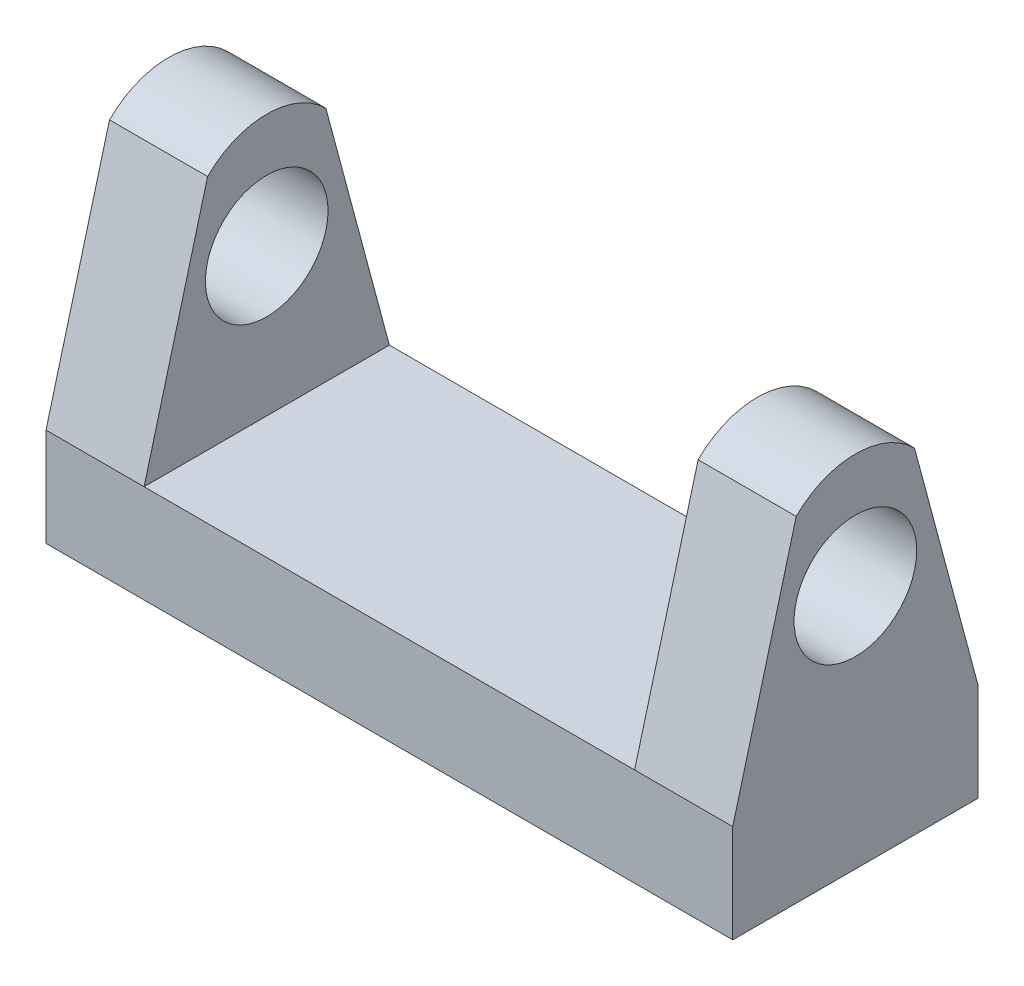
ISO-10303-21;
HEADER;
FILE_DESCRIPTION(('STEP AP214'),'2;1');
FILE_NAME('part.step','',(''),(''),'','','');
FILE_SCHEMA(('AUTOMOTIVE_DESIGN { 1 0 10303 214 1 1 1 1 }'));
ENDSEC;
DATA;
#1=APPLICATION_CONTEXT('core data for automotive mechanical design processes');
#2=APPLICATION_PROTOCOL_DEFINITION('international standard','automotive_design',2000,#1);
#3=PRODUCT_CONTEXT('',#1,'mechanical');
#4=PRODUCT('Part','Part','',(#3));
#5=PRODUCT_RELATED_PRODUCT_CATEGORY('part','',(#4));
#6=PRODUCT_DEFINITION_FORMATION('','',#4);
#7=PRODUCT_DEFINITION_CONTEXT('part definition',#1,'design');
#8=PRODUCT_DEFINITION('design','',#6,#7);
#9=PRODUCT_DEFINITION_SHAPE('','',#8);
#10=(LENGTH_UNIT() NAMED_UNIT(*) SI_UNIT(.MILLI.,.METRE.));
#11=(NAMED_UNIT(*) PLANE_ANGLE_UNIT() SI_UNIT($,.RADIAN.));
#12=(NAMED_UNIT(*) SI_UNIT($,.STERADIAN.) SOLID_ANGLE_UNIT());
#13=UNCERTAINTY_MEASURE_WITH_UNIT(LENGTH_MEASURE(1.E-05),#10,'distance_accuracy_value','');
#14=(GEOMETRIC_REPRESENTATION_CONTEXT(3) GLOBAL_UNCERTAINTY_ASSIGNED_CONTEXT((#13)) GLOBAL_UNIT_ASSIGNED_CONTEXT((#10,
#11,#12)) REPRESENTATION_CONTEXT('',''));
#15=CARTESIAN_POINT('',(0.,0.,0.));
#16=DIRECTION('',(0.,0.,1.));
#17=DIRECTION('',(1.,0.,0.));
#18=AXIS2_PLACEMENT_3D('',#15,#16,#17);
#19=CARTESIAN_POINT('',(-17.78,5.08,6.34999999999999));
#20=DIRECTION('',(-1.,0.,0.));
#21=DIRECTION('',(0.,0.,1.));
#22=AXIS2_PLACEMENT_3D('',#19,#20,#21);
#23=PLANE('',#22);
#24=CARTESIAN_POINT('',(-17.78,12.7,0.));
#25=DIRECTION('',(1.,0.,0.));
#26=DIRECTION('',(0.,0.,-1.));
#27=AXIS2_PLACEMENT_3D('',#24,#25,#26);
#28=CIRCLE('',#27,3.175);
#29=CARTESIAN_POINT('',(-17.78,12.7,-3.175));
#30=VERTEX_POINT('',#29);
#31=EDGE_CURVE('E194',#30,#30,#28,.T.);
#32=ORIENTED_EDGE('',*,*,#31,.T.);
#33=EDGE_LOOP('',(#32));
#34=FACE_BOUND('',#33,.T.);
#35=DIRECTION('',(0.,0.,-1.));
#36=VECTOR('',#35,1.);
#37=CARTESIAN_POINT('',(-17.78,0.,6.34999999999999));
#38=LINE('',#37,#36);
#39=CARTESIAN_POINT('',(-17.78,0.,6.34999999999999));
#40=VERTEX_POINT('',#39);
#41=CARTESIAN_POINT('',(-17.78,0.,-6.34999999999999));
#42=VERTEX_POINT('',#41);
#43=EDGE_CURVE('E106',#40,#42,#38,.T.);
#44=ORIENTED_EDGE('',*,*,#43,.F.);
#45=DIRECTION('',(0.,-1.,0.));
#46=VECTOR('',#45,1.);
#47=CARTESIAN_POINT('',(-17.78,5.08,6.34999999999999));
#48=LINE('',#47,#46);
#49=CARTESIAN_POINT('',(-17.78,5.08,6.34999999999999));
#50=VERTEX_POINT('',#49);
#51=EDGE_CURVE('E11',#50,#40,#48,.T.);
#52=ORIENTED_EDGE('',*,*,#51,.F.);
#53=DIRECTION('',(0.,-0.965925826289069,0.258819045102518));
#54=VECTOR('',#53,1.);
#55=CARTESIAN_POINT('',(-17.78,5.08,6.34999999999999));
#56=LINE('',#55,#54);
#57=CARTESIAN_POINT('',(-17.78,17.3472579938712,3.06299812719801));
#58=VERTEX_POINT('',#57);
#59=EDGE_CURVE('E176',#58,#50,#56,.T.);
#60=ORIENTED_EDGE('',*,*,#59,.F.);
#61=CARTESIAN_POINT('',(-17.78,14.2842598666732,0.));
#62=DIRECTION('',(1.,0.,0.));
#63=DIRECTION('',(0.,0.,1.));
#64=AXIS2_PLACEMENT_3D('',#61,#62,#63);
#65=CIRCLE('',#64,4.33173349300677);
#66=CARTESIAN_POINT('',(-17.78,17.3472579938712,-3.06299812719793));
#67=VERTEX_POINT('',#66);
#68=EDGE_CURVE('E173',#67,#58,#65,.T.);
#69=ORIENTED_EDGE('',*,*,#68,.F.);
#70=DIRECTION('',(0.,0.965925826289067,0.258819045102525));
#71=VECTOR('',#70,1.);
#72=CARTESIAN_POINT('',(-17.78,5.08,-6.34999999999999));
#73=LINE('',#72,#71);
#74=CARTESIAN_POINT('',(-17.78,5.08,-6.34999999999999));
#75=VERTEX_POINT('',#74);
#76=EDGE_CURVE('E170',#75,#67,#73,.T.);
#77=ORIENTED_EDGE('',*,*,#76,.F.);
#78=DIRECTION('',(0.,-1.,0.));
#79=VECTOR('',#78,1.);
#80=CARTESIAN_POINT('',(-17.78,5.08,-6.34999999999999));
#81=LINE('',#80,#79);
#82=EDGE_CURVE('E110',#75,#42,#81,.T.);
#83=ORIENTED_EDGE('',*,*,#82,.T.);
#84=EDGE_LOOP('',(#44,#52,#60,#69,#77,#83));
#85=FACE_BOUND('',#84,.T.);
#86=ADVANCED_FACE('F37',(#34,#85),#23,.T.);
#87=CARTESIAN_POINT('',(-17.78,5.08,6.34999999999999));
#88=DIRECTION('',(0.,0.,-1.));
#89=DIRECTION('',(-1.,0.,0.));
#90=AXIS2_PLACEMENT_3D('',#87,#88,#89);
#91=PLANE('',#90);
#92=DIRECTION('',(1.,0.,0.));
#93=VECTOR('',#92,1.);
#94=CARTESIAN_POINT('',(-17.78,0.,6.34999999999999));
#95=LINE('',#94,#93);
#96=CARTESIAN_POINT('',(17.78,0.,6.34999999999999));
#97=VERTEX_POINT('',#96);
#98=EDGE_CURVE('E79',#40,#97,#95,.T.);
#99=ORIENTED_EDGE('',*,*,#98,.T.);
#100=DIRECTION('',(0.,-1.,0.));
#101=VECTOR('',#100,1.);
#102=CARTESIAN_POINT('',(17.78,5.08,6.34999999999999));
#103=LINE('',#102,#101);
#104=CARTESIAN_POINT('',(17.78,5.08,6.34999999999999));
#105=VERTEX_POINT('',#104);
#106=EDGE_CURVE('E45',#105,#97,#103,.T.);
#107=ORIENTED_EDGE('',*,*,#106,.F.);
#108=DIRECTION('',(1.,0.,0.));
#109=VECTOR('',#108,1.);
#110=CARTESIAN_POINT('',(12.7,5.08,6.34999999999999));
#111=LINE('',#110,#109);
#112=CARTESIAN_POINT('',(12.7,5.08,6.34999999999999));
#113=VERTEX_POINT('',#112);
#114=EDGE_CURVE('E125',#113,#105,#111,.T.);
#115=ORIENTED_EDGE('',*,*,#114,.F.);
#116=DIRECTION('',(1.,0.,0.));
#117=VECTOR('',#116,1.);
#118=CARTESIAN_POINT('',(-17.78,5.08,6.34999999999999));
#119=LINE('',#118,#117);
#120=CARTESIAN_POINT('',(-12.7,5.08,6.34999999999999));
#121=VERTEX_POINT('',#120);
#122=EDGE_CURVE('E115',#121,#113,#119,.T.);
#123=ORIENTED_EDGE('',*,*,#122,.F.);
#124=EDGE_CURVE('E111',#50,#121,#119,.T.);
#125=ORIENTED_EDGE('',*,*,#124,.F.);
#126=ORIENTED_EDGE('',*,*,#51,.T.);
#127=EDGE_LOOP('',(#99,#107,#115,#123,#125,#126));
#128=FACE_BOUND('',#127,.T.);
#129=ADVANCED_FACE('F81',(#128),#91,.F.);
#130=CARTESIAN_POINT('',(17.78,5.08,6.34999999999999));
#131=DIRECTION('',(-1.,0.,0.));
#132=DIRECTION('',(0.,0.,1.));
#133=AXIS2_PLACEMENT_3D('',#130,#131,#132);
#134=PLANE('',#133);
#135=CARTESIAN_POINT('',(17.78,12.7,0.));
#136=DIRECTION('',(1.,0.,0.));
#137=DIRECTION('',(0.,0.,-1.));
#138=AXIS2_PLACEMENT_3D('',#135,#136,#137);
#139=CIRCLE('',#138,3.175);
#140=CARTESIAN_POINT('',(17.78,12.7,-3.175));
#141=VERTEX_POINT('',#140);
#142=EDGE_CURVE('E191',#141,#141,#139,.T.);
#143=ORIENTED_EDGE('',*,*,#142,.F.);
#144=EDGE_LOOP('',(#143));
#145=FACE_BOUND('',#144,.T.);
#146=DIRECTION('',(0.,0.,-1.));
#147=VECTOR('',#146,1.);
#148=CARTESIAN_POINT('',(17.78,0.,6.34999999999999));
#149=LINE('',#148,#147);
#150=CARTESIAN_POINT('',(17.78,0.,-6.34999999999999));
#151=VERTEX_POINT('',#150);
#152=EDGE_CURVE('E89',#97,#151,#149,.T.);
#153=ORIENTED_EDGE('',*,*,#152,.T.);
#154=DIRECTION('',(0.,-1.,0.));
#155=VECTOR('',#154,1.);
#156=CARTESIAN_POINT('',(17.78,5.08,-6.34999999999999));
#157=LINE('',#156,#155);
#158=CARTESIAN_POINT('',(17.78,5.08,-6.34999999999999));
#159=VERTEX_POINT('',#158);
#160=EDGE_CURVE('E100',#159,#151,#157,.T.);
#161=ORIENTED_EDGE('',*,*,#160,.F.);
#162=DIRECTION('',(0.,0.965925826289067,0.258819045102525));
#163=VECTOR('',#162,1.);
#164=CARTESIAN_POINT('',(17.78,5.08,-6.34999999999999));
#165=LINE('',#164,#163);
#166=CARTESIAN_POINT('',(17.78,17.3472579938712,-3.06299812719793));
#167=VERTEX_POINT('',#166);
#168=EDGE_CURVE('E151',#159,#167,#165,.T.);
#169=ORIENTED_EDGE('',*,*,#168,.T.);
#170=CARTESIAN_POINT('',(17.78,14.2842598666732,0.));
#171=DIRECTION('',(1.,0.,0.));
#172=DIRECTION('',(0.,0.,1.));
#173=AXIS2_PLACEMENT_3D('',#170,#171,#172);
#174=CIRCLE('',#173,4.33173349300677);
#175=CARTESIAN_POINT('',(17.78,17.3472579938712,3.06299812719801));
#176=VERTEX_POINT('',#175);
#177=EDGE_CURVE('E153',#167,#176,#174,.T.);
#178=ORIENTED_EDGE('',*,*,#177,.T.);
#179=DIRECTION('',(0.,-0.965925826289069,0.258819045102518));
#180=VECTOR('',#179,1.);
#181=CARTESIAN_POINT('',(17.78,5.08,6.34999999999999));
#182=LINE('',#181,#180);
#183=EDGE_CURVE('E99',#176,#105,#182,.T.);
#184=ORIENTED_EDGE('',*,*,#183,.T.);
#185=ORIENTED_EDGE('',*,*,#106,.T.);
#186=EDGE_LOOP('',(#153,#161,#169,#178,#184,#185));
#187=FACE_BOUND('',#186,.T.);
#188=ADVANCED_FACE('F94',(#145,#187),#134,.F.);
#189=CARTESIAN_POINT('',(-17.78,5.08,-6.34999999999999));
#190=DIRECTION('',(0.,0.,-1.));
#191=DIRECTION('',(-1.,0.,0.));
#192=AXIS2_PLACEMENT_3D('',#189,#190,#191);
#193=PLANE('',#192);
#194=DIRECTION('',(1.,0.,0.));
#195=VECTOR('',#194,1.);
#196=CARTESIAN_POINT('',(-17.78,0.,-6.34999999999999));
#197=LINE('',#196,#195);
#198=EDGE_CURVE('E104',#42,#151,#197,.T.);
#199=ORIENTED_EDGE('',*,*,#198,.F.);
#200=ORIENTED_EDGE('',*,*,#82,.F.);
#201=DIRECTION('',(1.,0.,0.));
#202=VECTOR('',#201,1.);
#203=CARTESIAN_POINT('',(-17.78,5.08,-6.34999999999999));
#204=LINE('',#203,#202);
#205=CARTESIAN_POINT('',(-12.7,5.08,-6.34999999999999));
#206=VERTEX_POINT('',#205);
#207=EDGE_CURVE('E61',#75,#206,#204,.T.);
#208=ORIENTED_EDGE('',*,*,#207,.T.);
#209=CARTESIAN_POINT('',(12.7,5.08,-6.34999999999999));
#210=VERTEX_POINT('',#209);
#211=EDGE_CURVE('E53',#206,#210,#204,.T.);
#212=ORIENTED_EDGE('',*,*,#211,.T.);
#213=DIRECTION('',(1.,0.,0.));
#214=VECTOR('',#213,1.);
#215=CARTESIAN_POINT('',(12.7,5.08,-6.34999999999999));
#216=LINE('',#215,#214);
#217=EDGE_CURVE('E138',#210,#159,#216,.T.);
#218=ORIENTED_EDGE('',*,*,#217,.T.);
#219=ORIENTED_EDGE('',*,*,#160,.T.);
#220=EDGE_LOOP('',(#199,#200,#208,#212,#218,#219));
#221=FACE_BOUND('',#220,.T.);
#222=ADVANCED_FACE('F215',(#221),#193,.T.);
#223=CARTESIAN_POINT('',(0.,5.08,0.));
#224=DIRECTION('',(0.,-1.,0.));
#225=DIRECTION('',(0.,0.,-1.));
#226=AXIS2_PLACEMENT_3D('',#223,#224,#225);
#227=PLANE('',#226);
#228=ORIENTED_EDGE('',*,*,#211,.F.);
#229=DIRECTION('',(0.,0.,-1.));
#230=VECTOR('',#229,1.);
#231=CARTESIAN_POINT('',(-12.7,5.08,6.34999999999999));
#232=LINE('',#231,#230);
#233=EDGE_CURVE('E172',#121,#206,#232,.T.);
#234=ORIENTED_EDGE('',*,*,#233,.F.);
#235=ORIENTED_EDGE('',*,*,#122,.T.);
#236=DIRECTION('',(0.,0.,-1.));
#237=VECTOR('',#236,1.);
#238=CARTESIAN_POINT('',(12.7,5.08,6.34999999999999));
#239=LINE('',#238,#237);
#240=EDGE_CURVE('E157',#113,#210,#239,.T.);
#241=ORIENTED_EDGE('',*,*,#240,.T.);
#242=EDGE_LOOP('',(#228,#234,#235,#241));
#243=FACE_BOUND('',#242,.T.);
#244=ADVANCED_FACE('F214',(#243),#227,.F.);
#245=CARTESIAN_POINT('',(0.,0.,0.));
#246=DIRECTION('',(0.,-1.,0.));
#247=DIRECTION('',(0.,0.,-1.));
#248=AXIS2_PLACEMENT_3D('',#245,#246,#247);
#249=PLANE('',#248);
#250=ORIENTED_EDGE('',*,*,#43,.T.);
#251=ORIENTED_EDGE('',*,*,#198,.T.);
#252=ORIENTED_EDGE('',*,*,#152,.F.);
#253=ORIENTED_EDGE('',*,*,#98,.F.);
#254=EDGE_LOOP('',(#250,#251,#252,#253));
#255=FACE_BOUND('',#254,.T.);
#256=ADVANCED_FACE('F102',(#255),#249,.T.);
#257=CARTESIAN_POINT('',(12.7,5.08,6.34999999999999));
#258=DIRECTION('',(0.,0.258819045102518,0.965925826289069));
#259=DIRECTION('',(0.,-0.965925826289069,0.258819045102518));
#260=AXIS2_PLACEMENT_3D('',#257,#258,#259);
#261=PLANE('',#260);
#262=ORIENTED_EDGE('',*,*,#183,.F.);
#263=DIRECTION('',(1.,0.,0.));
#264=VECTOR('',#263,1.);
#265=CARTESIAN_POINT('',(12.7,17.3472579938712,3.06299812719801));
#266=LINE('',#265,#264);
#267=CARTESIAN_POINT('',(12.7,17.3472579938712,3.06299812719801));
#268=VERTEX_POINT('',#267);
#269=EDGE_CURVE('E127',#268,#176,#266,.T.);
#270=ORIENTED_EDGE('',*,*,#269,.F.);
#271=DIRECTION('',(0.,-0.965925826289069,0.258819045102518));
#272=VECTOR('',#271,1.);
#273=CARTESIAN_POINT('',(12.7,5.08,6.34999999999999));
#274=LINE('',#273,#272);
#275=EDGE_CURVE('E139',#268,#113,#274,.T.);
#276=ORIENTED_EDGE('',*,*,#275,.T.);
#277=ORIENTED_EDGE('',*,*,#114,.T.);
#278=EDGE_LOOP('',(#262,#270,#276,#277));
#279=FACE_BOUND('',#278,.T.);
#280=ADVANCED_FACE('F269',(#279),#261,.T.);
#281=CARTESIAN_POINT('',(12.7,14.2842598666732,0.));
#282=DIRECTION('',(1.,0.,0.));
#283=DIRECTION('',(0.,0.,-1.));
#284=AXIS2_PLACEMENT_3D('',#281,#282,#283);
#285=CYLINDRICAL_SURFACE('',#284,4.33173349300677);
#286=ORIENTED_EDGE('',*,*,#177,.F.);
#287=DIRECTION('',(1.,0.,0.));
#288=VECTOR('',#287,1.);
#289=CARTESIAN_POINT('',(12.7,17.3472579938712,-3.06299812719793));
#290=LINE('',#289,#288);
#291=CARTESIAN_POINT('',(12.7,17.3472579938712,-3.06299812719793));
#292=VERTEX_POINT('',#291);
#293=EDGE_CURVE('E132',#292,#167,#290,.T.);
#294=ORIENTED_EDGE('',*,*,#293,.F.);
#295=CARTESIAN_POINT('',(12.7,14.2842598666732,0.));
#296=DIRECTION('',(1.,0.,0.));
#297=DIRECTION('',(0.,0.,1.));
#298=AXIS2_PLACEMENT_3D('',#295,#296,#297);
#299=CIRCLE('',#298,4.33173349300677);
#300=EDGE_CURVE('E142',#292,#268,#299,.T.);
#301=ORIENTED_EDGE('',*,*,#300,.T.);
#302=ORIENTED_EDGE('',*,*,#269,.T.);
#303=EDGE_LOOP('',(#286,#294,#301,#302));
#304=FACE_BOUND('',#303,.T.);
#305=ADVANCED_FACE('F262',(#304),#285,.T.);
#306=CARTESIAN_POINT('',(12.7,5.08,-6.34999999999999));
#307=DIRECTION('',(0.,0.258819045102525,-0.965925826289067));
#308=DIRECTION('',(0.,0.965925826289067,0.258819045102525));
#309=AXIS2_PLACEMENT_3D('',#306,#307,#308);
#310=PLANE('',#309);
#311=ORIENTED_EDGE('',*,*,#168,.F.);
#312=ORIENTED_EDGE('',*,*,#217,.F.);
#313=DIRECTION('',(0.,0.965925826289067,0.258819045102525));
#314=VECTOR('',#313,1.);
#315=CARTESIAN_POINT('',(12.7,5.08,-6.34999999999999));
#316=LINE('',#315,#314);
#317=EDGE_CURVE('E147',#210,#292,#316,.T.);
#318=ORIENTED_EDGE('',*,*,#317,.T.);
#319=ORIENTED_EDGE('',*,*,#293,.T.);
#320=EDGE_LOOP('',(#311,#312,#318,#319));
#321=FACE_BOUND('',#320,.T.);
#322=ADVANCED_FACE('F260',(#321),#310,.T.);
#323=CARTESIAN_POINT('',(12.7,14.2842598666732,0.));
#324=DIRECTION('',(-1.,0.,0.));
#325=DIRECTION('',(0.,0.,1.));
#326=AXIS2_PLACEMENT_3D('',#323,#324,#325);
#327=PLANE('',#326);
#328=CARTESIAN_POINT('',(12.7,12.7,0.));
#329=DIRECTION('',(-1.,0.,0.));
#330=DIRECTION('',(0.,0.,1.));
#331=AXIS2_PLACEMENT_3D('',#328,#329,#330);
#332=CIRCLE('',#331,3.175);
#333=CARTESIAN_POINT('',(12.7,12.7,3.175));
#334=VERTEX_POINT('',#333);
#335=EDGE_CURVE('E178',#334,#334,#332,.T.);
#336=ORIENTED_EDGE('',*,*,#335,.F.);
#337=EDGE_LOOP('',(#336));
#338=FACE_BOUND('',#337,.T.);
#339=ORIENTED_EDGE('',*,*,#240,.F.);
#340=ORIENTED_EDGE('',*,*,#275,.F.);
#341=ORIENTED_EDGE('',*,*,#300,.F.);
#342=ORIENTED_EDGE('',*,*,#317,.F.);
#343=EDGE_LOOP('',(#339,#340,#341,#342));
#344=FACE_BOUND('',#343,.T.);
#345=ADVANCED_FACE('F259',(#338,#344),#327,.T.);
#346=CARTESIAN_POINT('',(-12.7,5.08,-6.34999999999999));
#347=DIRECTION('',(0.,-0.258819045102525,0.965925826289067));
#348=DIRECTION('',(0.,-0.965925826289067,-0.258819045102525));
#349=AXIS2_PLACEMENT_3D('',#346,#347,#348);
#350=PLANE('',#349);
#351=ORIENTED_EDGE('',*,*,#76,.T.);
#352=DIRECTION('',(-1.,0.,0.));
#353=VECTOR('',#352,1.);
#354=CARTESIAN_POINT('',(-12.7,17.3472579938712,-3.06299812719793));
#355=LINE('',#354,#353);
#356=CARTESIAN_POINT('',(-12.7,17.3472579938712,-3.06299812719793));
#357=VERTEX_POINT('',#356);
#358=EDGE_CURVE('E154',#357,#67,#355,.T.);
#359=ORIENTED_EDGE('',*,*,#358,.F.);
#360=DIRECTION('',(0.,0.965925826289067,0.258819045102525));
#361=VECTOR('',#360,1.);
#362=CARTESIAN_POINT('',(-12.7,5.08,-6.34999999999999));
#363=LINE('',#362,#361);
#364=EDGE_CURVE('E167',#206,#357,#363,.T.);
#365=ORIENTED_EDGE('',*,*,#364,.F.);
#366=ORIENTED_EDGE('',*,*,#207,.F.);
#367=EDGE_LOOP('',(#351,#359,#365,#366));
#368=FACE_BOUND('',#367,.T.);
#369=ADVANCED_FACE('F250',(#368),#350,.F.);
#370=CARTESIAN_POINT('',(-12.7,14.2842598666732,0.));
#371=DIRECTION('',(-1.,0.,0.));
#372=DIRECTION('',(0.,0.,1.));
#373=AXIS2_PLACEMENT_3D('',#370,#371,#372);
#374=CYLINDRICAL_SURFACE('',#373,4.33173349300677);
#375=ORIENTED_EDGE('',*,*,#68,.T.);
#376=DIRECTION('',(-1.,0.,0.));
#377=VECTOR('',#376,1.);
#378=CARTESIAN_POINT('',(-12.7,17.3472579938712,3.06299812719801));
#379=LINE('',#378,#377);
#380=CARTESIAN_POINT('',(-12.7,17.3472579938712,3.06299812719801));
#381=VERTEX_POINT('',#380);
#382=EDGE_CURVE('E164',#381,#58,#379,.T.);
#383=ORIENTED_EDGE('',*,*,#382,.F.);
#384=CARTESIAN_POINT('',(-12.7,14.2842598666732,0.));
#385=DIRECTION('',(1.,0.,0.));
#386=DIRECTION('',(0.,0.,1.));
#387=AXIS2_PLACEMENT_3D('',#384,#385,#386);
#388=CIRCLE('',#387,4.33173349300677);
#389=EDGE_CURVE('E181',#357,#381,#388,.T.);
#390=ORIENTED_EDGE('',*,*,#389,.F.);
#391=ORIENTED_EDGE('',*,*,#358,.T.);
#392=EDGE_LOOP('',(#375,#383,#390,#391));
#393=FACE_BOUND('',#392,.T.);
#394=ADVANCED_FACE('F242',(#393),#374,.T.);
#395=CARTESIAN_POINT('',(-12.7,5.08,6.34999999999999));
#396=DIRECTION('',(0.,-0.258819045102518,-0.965925826289069));
#397=DIRECTION('',(0.,0.965925826289069,-0.258819045102518));
#398=AXIS2_PLACEMENT_3D('',#395,#396,#397);
#399=PLANE('',#398);
#400=ORIENTED_EDGE('',*,*,#59,.T.);
#401=ORIENTED_EDGE('',*,*,#124,.T.);
#402=DIRECTION('',(0.,-0.965925826289069,0.258819045102518));
#403=VECTOR('',#402,1.);
#404=CARTESIAN_POINT('',(-12.7,5.08,6.34999999999999));
#405=LINE('',#404,#403);
#406=EDGE_CURVE('E184',#381,#121,#405,.T.);
#407=ORIENTED_EDGE('',*,*,#406,.F.);
#408=ORIENTED_EDGE('',*,*,#382,.T.);
#409=EDGE_LOOP('',(#400,#401,#407,#408));
#410=FACE_BOUND('',#409,.T.);
#411=ADVANCED_FACE('F207',(#410),#399,.F.);
#412=CARTESIAN_POINT('',(-12.7,14.2842598666732,0.));
#413=DIRECTION('',(1.,0.,0.));
#414=DIRECTION('',(0.,0.,1.));
#415=AXIS2_PLACEMENT_3D('',#412,#413,#414);
#416=PLANE('',#415);
#417=CARTESIAN_POINT('',(-12.7,12.7,0.));
#418=DIRECTION('',(1.,0.,0.));
#419=DIRECTION('',(0.,0.,-1.));
#420=AXIS2_PLACEMENT_3D('',#417,#418,#419);
#421=CIRCLE('',#420,3.175);
#422=CARTESIAN_POINT('',(-12.7,12.7,-3.175));
#423=VERTEX_POINT('',#422);
#424=EDGE_CURVE('E40',#423,#423,#421,.T.);
#425=ORIENTED_EDGE('',*,*,#424,.F.);
#426=EDGE_LOOP('',(#425));
#427=FACE_BOUND('',#426,.T.);
#428=ORIENTED_EDGE('',*,*,#233,.T.);
#429=ORIENTED_EDGE('',*,*,#364,.T.);
#430=ORIENTED_EDGE('',*,*,#389,.T.);
#431=ORIENTED_EDGE('',*,*,#406,.T.);
#432=EDGE_LOOP('',(#428,#429,#430,#431));
#433=FACE_BOUND('',#432,.T.);
#434=ADVANCED_FACE('F204',(#427,#433),#416,.T.);
#435=CARTESIAN_POINT('',(-17.78,12.7,0.));
#436=DIRECTION('',(1.,0.,0.));
#437=DIRECTION('',(0.,0.,-1.));
#438=AXIS2_PLACEMENT_3D('',#435,#436,#437);
#439=CYLINDRICAL_SURFACE('',#438,3.175);
#440=ORIENTED_EDGE('',*,*,#424,.T.);
#441=EDGE_LOOP('',(#440));
#442=FACE_BOUND('',#441,.T.);
#443=ORIENTED_EDGE('',*,*,#31,.F.);
#444=EDGE_LOOP('',(#443));
#445=FACE_BOUND('',#444,.T.);
#446=ADVANCED_FACE('F201',(#442,#445),#439,.F.);
#447=ORIENTED_EDGE('',*,*,#335,.T.);
#448=EDGE_LOOP('',(#447));
#449=FACE_BOUND('',#448,.T.);
#450=ORIENTED_EDGE('',*,*,#142,.T.);
#451=EDGE_LOOP('',(#450));
#452=FACE_BOUND('',#451,.T.);
#453=ADVANCED_FACE('F337',(#449,#452),#439,.F.);
#454=CLOSED_SHELL('',(#86,#129,#188,#222,#244,#256,#280,#305,#322,#345,#369,#394,#411,#434,#446,#453));
#455=MANIFOLD_SOLID_BREP('B2',#454);
#456=ADVANCED_BREP_SHAPE_REPRESENTATION('',(#18,#455),#14);
#457=SHAPE_DEFINITION_REPRESENTATION(#9,#456);
ENDSEC;
END-ISO-10303-21;
